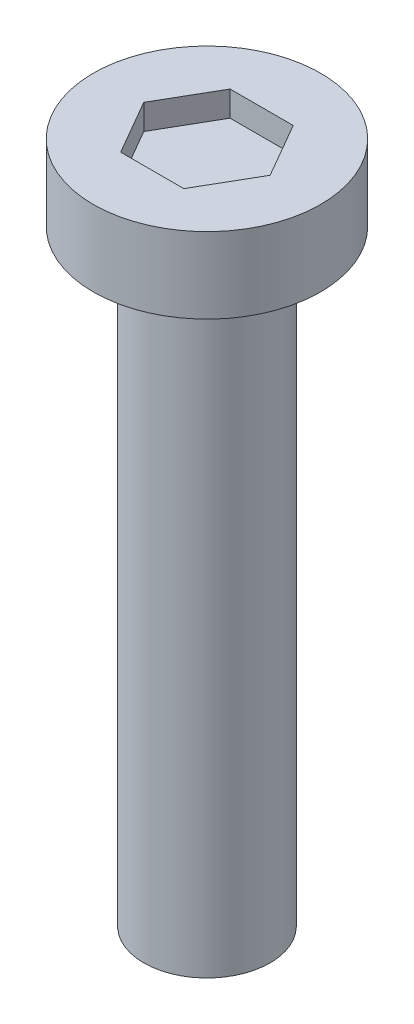
ISO-10303-21;
HEADER;
FILE_DESCRIPTION(('STEP AP214'),'2;1');
FILE_NAME('part.step','',(''),(''),'','','');
FILE_SCHEMA(('AUTOMOTIVE_DESIGN { 1 0 10303 214 1 1 1 1 }'));
ENDSEC;
DATA;
#1=APPLICATION_CONTEXT('core data for automotive mechanical design processes');
#2=APPLICATION_PROTOCOL_DEFINITION('international standard','automotive_design',2000,#1);
#3=PRODUCT_CONTEXT('',#1,'mechanical');
#4=PRODUCT('Part','Part','',(#3));
#5=PRODUCT_RELATED_PRODUCT_CATEGORY('part','',(#4));
#6=PRODUCT_DEFINITION_FORMATION('','',#4);
#7=PRODUCT_DEFINITION_CONTEXT('part definition',#1,'design');
#8=PRODUCT_DEFINITION('design','',#6,#7);
#9=PRODUCT_DEFINITION_SHAPE('','',#8);
#10=(LENGTH_UNIT() NAMED_UNIT(*) SI_UNIT(.MILLI.,.METRE.));
#11=(NAMED_UNIT(*) PLANE_ANGLE_UNIT() SI_UNIT($,.RADIAN.));
#12=(NAMED_UNIT(*) SI_UNIT($,.STERADIAN.) SOLID_ANGLE_UNIT());
#13=UNCERTAINTY_MEASURE_WITH_UNIT(LENGTH_MEASURE(1.E-05),#10,'distance_accuracy_value','');
#14=(GEOMETRIC_REPRESENTATION_CONTEXT(3) GLOBAL_UNCERTAINTY_ASSIGNED_CONTEXT((#13)) GLOBAL_UNIT_ASSIGNED_CONTEXT((#10,
#11,#12)) REPRESENTATION_CONTEXT('',''));
#15=CARTESIAN_POINT('',(0.,0.,0.));
#16=DIRECTION('',(0.,0.,1.));
#17=DIRECTION('',(1.,0.,0.));
#18=AXIS2_PLACEMENT_3D('',#15,#16,#17);
#19=CARTESIAN_POINT('',(0.,12.,0.));
#20=DIRECTION('',(0.,-1.,0.));
#21=DIRECTION('',(0.,0.,-1.));
#22=AXIS2_PLACEMENT_3D('',#19,#20,#21);
#23=CYLINDRICAL_SURFACE('',#22,1.25);
#24=CARTESIAN_POINT('',(0.,12.,0.));
#25=DIRECTION('',(0.,1.,0.));
#26=DIRECTION('',(0.,0.,1.));
#27=AXIS2_PLACEMENT_3D('',#24,#25,#26);
#28=CIRCLE('',#27,1.25);
#29=CARTESIAN_POINT('',(0.,12.,1.25));
#30=VERTEX_POINT('',#29);
#31=EDGE_CURVE('E11',#30,#30,#28,.T.);
#32=ORIENTED_EDGE('',*,*,#31,.F.);
#33=EDGE_LOOP('',(#32));
#34=FACE_BOUND('',#33,.T.);
#35=CARTESIAN_POINT('',(0.,0.,0.));
#36=DIRECTION('',(0.,1.,0.));
#37=DIRECTION('',(0.,0.,1.));
#38=AXIS2_PLACEMENT_3D('',#35,#36,#37);
#39=CIRCLE('',#38,1.25);
#40=CARTESIAN_POINT('',(0.,0.,1.25));
#41=VERTEX_POINT('',#40);
#42=EDGE_CURVE('E42',#41,#41,#39,.T.);
#43=ORIENTED_EDGE('',*,*,#42,.T.);
#44=EDGE_LOOP('',(#43));
#45=FACE_BOUND('',#44,.T.);
#46=ADVANCED_FACE('F39',(#34,#45),#23,.T.);
#47=CARTESIAN_POINT('',(0.,0.,0.));
#48=DIRECTION('',(0.,1.,0.));
#49=DIRECTION('',(0.,0.,1.));
#50=AXIS2_PLACEMENT_3D('',#47,#48,#49);
#51=PLANE('',#50);
#52=ORIENTED_EDGE('',*,*,#42,.F.);
#53=EDGE_LOOP('',(#52));
#54=FACE_BOUND('',#53,.T.);
#55=ADVANCED_FACE('F189',(#54),#51,.F.);
#56=CARTESIAN_POINT('',(0.,13.5,0.));
#57=DIRECTION('',(0.,-1.,0.));
#58=DIRECTION('',(0.,0.,-1.));
#59=AXIS2_PLACEMENT_3D('',#56,#57,#58);
#60=CYLINDRICAL_SURFACE('',#59,2.25);
#61=CARTESIAN_POINT('',(0.,13.5,0.));
#62=DIRECTION('',(0.,1.,0.));
#63=DIRECTION('',(0.,0.,1.));
#64=AXIS2_PLACEMENT_3D('',#61,#62,#63);
#65=CIRCLE('',#64,2.25);
#66=CARTESIAN_POINT('',(0.,13.5,2.25));
#67=VERTEX_POINT('',#66);
#68=EDGE_CURVE('E163',#67,#67,#65,.T.);
#69=ORIENTED_EDGE('',*,*,#68,.F.);
#70=EDGE_LOOP('',(#69));
#71=FACE_BOUND('',#70,.T.);
#72=CARTESIAN_POINT('',(0.,12.,0.));
#73=DIRECTION('',(0.,1.,0.));
#74=DIRECTION('',(0.,0.,1.));
#75=AXIS2_PLACEMENT_3D('',#72,#73,#74);
#76=CIRCLE('',#75,2.25);
#77=CARTESIAN_POINT('',(0.,12.,2.25));
#78=VERTEX_POINT('',#77);
#79=EDGE_CURVE('E153',#78,#78,#76,.T.);
#80=ORIENTED_EDGE('',*,*,#79,.T.);
#81=EDGE_LOOP('',(#80));
#82=FACE_BOUND('',#81,.T.);
#83=ADVANCED_FACE('F171',(#71,#82),#60,.T.);
#84=CARTESIAN_POINT('',(0.,13.5,0.));
#85=DIRECTION('',(0.,1.,0.));
#86=DIRECTION('',(0.,0.,1.));
#87=AXIS2_PLACEMENT_3D('',#84,#85,#86);
#88=PLANE('',#87);
#89=DIRECTION('',(0.5,0.,-0.866025403784439));
#90=VECTOR('',#89,1.);
#91=CARTESIAN_POINT('',(0.625,13.5,1.08253175473055));
#92=LINE('',#91,#90);
#93=CARTESIAN_POINT('',(0.625,13.5,1.08253175473055));
#94=VERTEX_POINT('',#93);
#95=CARTESIAN_POINT('',(1.25,13.5,0.));
#96=VERTEX_POINT('',#95);
#97=EDGE_CURVE('E54',#94,#96,#92,.T.);
#98=ORIENTED_EDGE('',*,*,#97,.F.);
#99=DIRECTION('',(1.,0.,0.));
#100=VECTOR('',#99,1.);
#101=CARTESIAN_POINT('',(-0.625,13.5,1.08253175473055));
#102=LINE('',#101,#100);
#103=CARTESIAN_POINT('',(-0.625,13.5,1.08253175473055));
#104=VERTEX_POINT('',#103);
#105=EDGE_CURVE('E147',#104,#94,#102,.T.);
#106=ORIENTED_EDGE('',*,*,#105,.F.);
#107=DIRECTION('',(0.5,0.,0.866025403784439));
#108=VECTOR('',#107,1.);
#109=CARTESIAN_POINT('',(-1.25,13.5,0.));
#110=LINE('',#109,#108);
#111=CARTESIAN_POINT('',(-1.25,13.5,0.));
#112=VERTEX_POINT('',#111);
#113=EDGE_CURVE('E144',#112,#104,#110,.T.);
#114=ORIENTED_EDGE('',*,*,#113,.F.);
#115=DIRECTION('',(-0.5,0.,0.866025403784439));
#116=VECTOR('',#115,1.);
#117=CARTESIAN_POINT('',(-0.625,13.5,-1.08253175473055));
#118=LINE('',#117,#116);
#119=CARTESIAN_POINT('',(-0.625,13.5,-1.08253175473055));
#120=VERTEX_POINT('',#119);
#121=EDGE_CURVE('E102',#120,#112,#118,.T.);
#122=ORIENTED_EDGE('',*,*,#121,.F.);
#123=DIRECTION('',(-1.,0.,0.));
#124=VECTOR('',#123,1.);
#125=CARTESIAN_POINT('',(0.625,13.5,-1.08253175473055));
#126=LINE('',#125,#124);
#127=CARTESIAN_POINT('',(0.625,13.5,-1.08253175473055));
#128=VERTEX_POINT('',#127);
#129=EDGE_CURVE('E138',#128,#120,#126,.T.);
#130=ORIENTED_EDGE('',*,*,#129,.F.);
#131=DIRECTION('',(-0.5,0.,-0.866025403784439));
#132=VECTOR('',#131,1.);
#133=CARTESIAN_POINT('',(1.25,13.5,0.));
#134=LINE('',#133,#132);
#135=EDGE_CURVE('E134',#96,#128,#134,.T.);
#136=ORIENTED_EDGE('',*,*,#135,.F.);
#137=EDGE_LOOP('',(#98,#106,#114,#122,#130,#136));
#138=FACE_BOUND('',#137,.T.);
#139=ORIENTED_EDGE('',*,*,#68,.T.);
#140=EDGE_LOOP('',(#139));
#141=FACE_BOUND('',#140,.T.);
#142=ADVANCED_FACE('F176',(#138,#141),#88,.T.);
#143=CARTESIAN_POINT('',(0.,12.,0.));
#144=DIRECTION('',(0.,1.,0.));
#145=DIRECTION('',(0.,0.,1.));
#146=AXIS2_PLACEMENT_3D('',#143,#144,#145);
#147=PLANE('',#146);
#148=ORIENTED_EDGE('',*,*,#31,.T.);
#149=EDGE_LOOP('',(#148));
#150=FACE_BOUND('',#149,.T.);
#151=ORIENTED_EDGE('',*,*,#79,.F.);
#152=EDGE_LOOP('',(#151));
#153=FACE_BOUND('',#152,.T.);
#154=ADVANCED_FACE('F173',(#150,#153),#147,.F.);
#155=CARTESIAN_POINT('',(0.625,13.,1.08253175473055));
#156=DIRECTION('',(0.866025403784439,0.,0.5));
#157=DIRECTION('',(0.5,0.,-0.866025403784439));
#158=AXIS2_PLACEMENT_3D('',#155,#156,#157);
#159=PLANE('',#158);
#160=ORIENTED_EDGE('',*,*,#97,.T.);
#161=DIRECTION('',(0.,1.,0.));
#162=VECTOR('',#161,1.);
#163=CARTESIAN_POINT('',(1.25,13.,0.));
#164=LINE('',#163,#162);
#165=CARTESIAN_POINT('',(1.25,13.,0.));
#166=VERTEX_POINT('',#165);
#167=EDGE_CURVE('E84',#166,#96,#164,.T.);
#168=ORIENTED_EDGE('',*,*,#167,.F.);
#169=DIRECTION('',(0.5,0.,-0.866025403784439));
#170=VECTOR('',#169,1.);
#171=CARTESIAN_POINT('',(0.625,13.,1.08253175473055));
#172=LINE('',#171,#170);
#173=CARTESIAN_POINT('',(0.625,13.,1.08253175473055));
#174=VERTEX_POINT('',#173);
#175=EDGE_CURVE('E150',#174,#166,#172,.T.);
#176=ORIENTED_EDGE('',*,*,#175,.F.);
#177=DIRECTION('',(0.,1.,0.));
#178=VECTOR('',#177,1.);
#179=CARTESIAN_POINT('',(0.625,13.,1.08253175473055));
#180=LINE('',#179,#178);
#181=EDGE_CURVE('E62',#174,#94,#180,.T.);
#182=ORIENTED_EDGE('',*,*,#181,.T.);
#183=EDGE_LOOP('',(#160,#168,#176,#182));
#184=FACE_BOUND('',#183,.T.);
#185=ADVANCED_FACE('F175',(#184),#159,.F.);
#186=CARTESIAN_POINT('',(-0.625,13.,1.08253175473055));
#187=DIRECTION('',(0.,0.,1.));
#188=DIRECTION('',(1.,0.,0.));
#189=AXIS2_PLACEMENT_3D('',#186,#187,#188);
#190=PLANE('',#189);
#191=ORIENTED_EDGE('',*,*,#105,.T.);
#192=ORIENTED_EDGE('',*,*,#181,.F.);
#193=DIRECTION('',(1.,0.,0.));
#194=VECTOR('',#193,1.);
#195=CARTESIAN_POINT('',(-0.625,13.,1.08253175473055));
#196=LINE('',#195,#194);
#197=CARTESIAN_POINT('',(-0.625,13.,1.08253175473055));
#198=VERTEX_POINT('',#197);
#199=EDGE_CURVE('E116',#198,#174,#196,.T.);
#200=ORIENTED_EDGE('',*,*,#199,.F.);
#201=DIRECTION('',(0.,1.,0.));
#202=VECTOR('',#201,1.);
#203=CARTESIAN_POINT('',(-0.625,13.,1.08253175473055));
#204=LINE('',#203,#202);
#205=EDGE_CURVE('E107',#198,#104,#204,.T.);
#206=ORIENTED_EDGE('',*,*,#205,.T.);
#207=EDGE_LOOP('',(#191,#192,#200,#206));
#208=FACE_BOUND('',#207,.T.);
#209=ADVANCED_FACE('F183',(#208),#190,.F.);
#210=CARTESIAN_POINT('',(-1.25,13.,0.));
#211=DIRECTION('',(-0.866025403784439,0.,0.5));
#212=DIRECTION('',(0.5,0.,0.866025403784439));
#213=AXIS2_PLACEMENT_3D('',#210,#211,#212);
#214=PLANE('',#213);
#215=ORIENTED_EDGE('',*,*,#113,.T.);
#216=ORIENTED_EDGE('',*,*,#205,.F.);
#217=DIRECTION('',(0.5,0.,0.866025403784439));
#218=VECTOR('',#217,1.);
#219=CARTESIAN_POINT('',(-1.25,13.,0.));
#220=LINE('',#219,#218);
#221=CARTESIAN_POINT('',(-1.25,13.,0.));
#222=VERTEX_POINT('',#221);
#223=EDGE_CURVE('E111',#222,#198,#220,.T.);
#224=ORIENTED_EDGE('',*,*,#223,.F.);
#225=DIRECTION('',(0.,1.,0.));
#226=VECTOR('',#225,1.);
#227=CARTESIAN_POINT('',(-1.25,13.,0.));
#228=LINE('',#227,#226);
#229=EDGE_CURVE('E95',#222,#112,#228,.T.);
#230=ORIENTED_EDGE('',*,*,#229,.T.);
#231=EDGE_LOOP('',(#215,#216,#224,#230));
#232=FACE_BOUND('',#231,.T.);
#233=ADVANCED_FACE('F112',(#232),#214,.F.);
#234=CARTESIAN_POINT('',(-0.625,13.,-1.08253175473055));
#235=DIRECTION('',(-0.866025403784439,0.,-0.5));
#236=DIRECTION('',(-0.5,0.,0.866025403784439));
#237=AXIS2_PLACEMENT_3D('',#234,#235,#236);
#238=PLANE('',#237);
#239=ORIENTED_EDGE('',*,*,#121,.T.);
#240=ORIENTED_EDGE('',*,*,#229,.F.);
#241=DIRECTION('',(-0.5,0.,0.866025403784439));
#242=VECTOR('',#241,1.);
#243=CARTESIAN_POINT('',(-0.625,13.,-1.08253175473055));
#244=LINE('',#243,#242);
#245=CARTESIAN_POINT('',(-0.625,13.,-1.08253175473055));
#246=VERTEX_POINT('',#245);
#247=EDGE_CURVE('E99',#246,#222,#244,.T.);
#248=ORIENTED_EDGE('',*,*,#247,.F.);
#249=DIRECTION('',(0.,1.,0.));
#250=VECTOR('',#249,1.);
#251=CARTESIAN_POINT('',(-0.625,13.,-1.08253175473055));
#252=LINE('',#251,#250);
#253=EDGE_CURVE('E108',#246,#120,#252,.T.);
#254=ORIENTED_EDGE('',*,*,#253,.T.);
#255=EDGE_LOOP('',(#239,#240,#248,#254));
#256=FACE_BOUND('',#255,.T.);
#257=ADVANCED_FACE('F97',(#256),#238,.F.);
#258=CARTESIAN_POINT('',(0.625,13.,-1.08253175473055));
#259=DIRECTION('',(0.,0.,-1.));
#260=DIRECTION('',(-1.,0.,0.));
#261=AXIS2_PLACEMENT_3D('',#258,#259,#260);
#262=PLANE('',#261);
#263=ORIENTED_EDGE('',*,*,#129,.T.);
#264=ORIENTED_EDGE('',*,*,#253,.F.);
#265=DIRECTION('',(-1.,0.,0.));
#266=VECTOR('',#265,1.);
#267=CARTESIAN_POINT('',(0.625,13.,-1.08253175473055));
#268=LINE('',#267,#266);
#269=CARTESIAN_POINT('',(0.625,13.,-1.08253175473055));
#270=VERTEX_POINT('',#269);
#271=EDGE_CURVE('E122',#270,#246,#268,.T.);
#272=ORIENTED_EDGE('',*,*,#271,.F.);
#273=DIRECTION('',(0.,1.,0.));
#274=VECTOR('',#273,1.);
#275=CARTESIAN_POINT('',(0.625,13.,-1.08253175473055));
#276=LINE('',#275,#274);
#277=EDGE_CURVE('E158',#270,#128,#276,.T.);
#278=ORIENTED_EDGE('',*,*,#277,.T.);
#279=EDGE_LOOP('',(#263,#264,#272,#278));
#280=FACE_BOUND('',#279,.T.);
#281=ADVANCED_FACE('F245',(#280),#262,.F.);
#282=CARTESIAN_POINT('',(1.25,13.,0.));
#283=DIRECTION('',(0.866025403784439,0.,-0.5));
#284=DIRECTION('',(-0.5,0.,-0.866025403784439));
#285=AXIS2_PLACEMENT_3D('',#282,#283,#284);
#286=PLANE('',#285);
#287=ORIENTED_EDGE('',*,*,#135,.T.);
#288=ORIENTED_EDGE('',*,*,#277,.F.);
#289=DIRECTION('',(-0.5,0.,-0.866025403784439));
#290=VECTOR('',#289,1.);
#291=CARTESIAN_POINT('',(1.25,13.,0.));
#292=LINE('',#291,#290);
#293=EDGE_CURVE('E126',#166,#270,#292,.T.);
#294=ORIENTED_EDGE('',*,*,#293,.F.);
#295=ORIENTED_EDGE('',*,*,#167,.T.);
#296=EDGE_LOOP('',(#287,#288,#294,#295));
#297=FACE_BOUND('',#296,.T.);
#298=ADVANCED_FACE('F254',(#297),#286,.F.);
#299=CARTESIAN_POINT('',(0.,13.,0.));
#300=DIRECTION('',(0.,1.,0.));
#301=DIRECTION('',(0.,0.,1.));
#302=AXIS2_PLACEMENT_3D('',#299,#300,#301);
#303=PLANE('',#302);
#304=ORIENTED_EDGE('',*,*,#175,.T.);
#305=ORIENTED_EDGE('',*,*,#293,.T.);
#306=ORIENTED_EDGE('',*,*,#271,.T.);
#307=ORIENTED_EDGE('',*,*,#247,.T.);
#308=ORIENTED_EDGE('',*,*,#223,.T.);
#309=ORIENTED_EDGE('',*,*,#199,.T.);
#310=EDGE_LOOP('',(#304,#305,#306,#307,#308,#309));
#311=FACE_BOUND('',#310,.T.);
#312=ADVANCED_FACE('F119',(#311),#303,.T.);
#313=CLOSED_SHELL('',(#46,#55,#83,#142,#154,#185,#209,#233,#257,#281,#298,#312));
#314=MANIFOLD_SOLID_BREP('B2',#313);
#315=ADVANCED_BREP_SHAPE_REPRESENTATION('',(#18,#314),#14);
#316=SHAPE_DEFINITION_REPRESENTATION(#9,#315);
ENDSEC;
END-ISO-10303-21;
